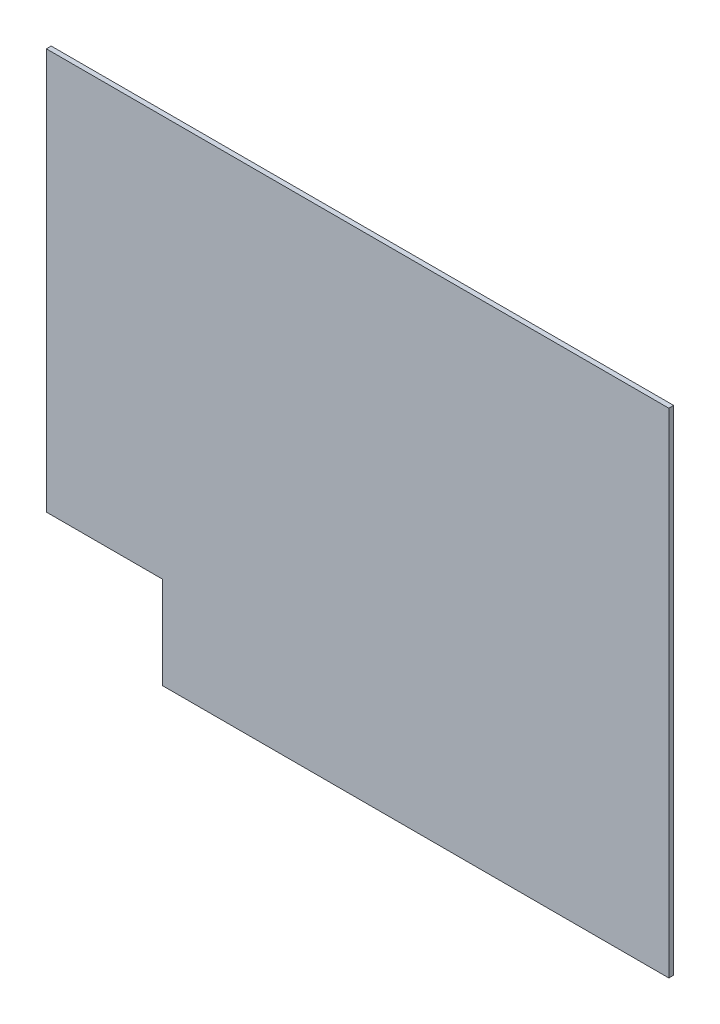
ISO-10303-21;
HEADER;
FILE_DESCRIPTION(('STEP AP214'),'2;1');
FILE_NAME('part.step','',(''),(''),'','','');
FILE_SCHEMA(('AUTOMOTIVE_DESIGN { 1 0 10303 214 1 1 1 1 }'));
ENDSEC;
DATA;
#1=APPLICATION_CONTEXT('core data for automotive mechanical design processes');
#2=APPLICATION_PROTOCOL_DEFINITION('international standard','automotive_design',2000,#1);
#3=PRODUCT_CONTEXT('',#1,'mechanical');
#4=PRODUCT('Part','Part','',(#3));
#5=PRODUCT_RELATED_PRODUCT_CATEGORY('part','',(#4));
#6=PRODUCT_DEFINITION_FORMATION('','',#4);
#7=PRODUCT_DEFINITION_CONTEXT('part definition',#1,'design');
#8=PRODUCT_DEFINITION('design','',#6,#7);
#9=PRODUCT_DEFINITION_SHAPE('','',#8);
#10=(LENGTH_UNIT() NAMED_UNIT(*) SI_UNIT(.MILLI.,.METRE.));
#11=(NAMED_UNIT(*) PLANE_ANGLE_UNIT() SI_UNIT($,.RADIAN.));
#12=(NAMED_UNIT(*) SI_UNIT($,.STERADIAN.) SOLID_ANGLE_UNIT());
#13=UNCERTAINTY_MEASURE_WITH_UNIT(LENGTH_MEASURE(1.E-05),#10,'distance_accuracy_value','');
#14=(GEOMETRIC_REPRESENTATION_CONTEXT(3) GLOBAL_UNCERTAINTY_ASSIGNED_CONTEXT((#13)) GLOBAL_UNIT_ASSIGNED_CONTEXT((#10,
#11,#12)) REPRESENTATION_CONTEXT('',''));
#15=CARTESIAN_POINT('',(0.,0.,0.));
#16=DIRECTION('',(0.,0.,1.));
#17=DIRECTION('',(1.,0.,0.));
#18=AXIS2_PLACEMENT_3D('',#15,#16,#17);
#19=CARTESIAN_POINT('',(289.5,-229.5,2.2479));
#20=DIRECTION('',(-1.,0.,0.));
#21=DIRECTION('',(0.,0.,1.));
#22=AXIS2_PLACEMENT_3D('',#19,#20,#21);
#23=PLANE('',#22);
#24=DIRECTION('',(0.,1.,0.));
#25=VECTOR('',#24,1.);
#26=CARTESIAN_POINT('',(289.5,-229.5,-2.2479));
#27=LINE('',#26,#25);
#28=CARTESIAN_POINT('',(289.5,-229.5,-2.2479));
#29=VERTEX_POINT('',#28);
#30=CARTESIAN_POINT('',(289.5,229.5,-2.2479));
#31=VERTEX_POINT('',#30);
#32=EDGE_CURVE('E108',#29,#31,#27,.T.);
#33=ORIENTED_EDGE('',*,*,#32,.T.);
#34=DIRECTION('',(0.,0.,-1.));
#35=VECTOR('',#34,1.);
#36=CARTESIAN_POINT('',(289.5,229.5,2.2479));
#37=LINE('',#36,#35);
#38=CARTESIAN_POINT('',(289.5,229.5,2.2479));
#39=VERTEX_POINT('',#38);
#40=EDGE_CURVE('E11',#39,#31,#37,.T.);
#41=ORIENTED_EDGE('',*,*,#40,.F.);
#42=DIRECTION('',(0.,1.,0.));
#43=VECTOR('',#42,1.);
#44=CARTESIAN_POINT('',(289.5,-229.5,2.2479));
#45=LINE('',#44,#43);
#46=CARTESIAN_POINT('',(289.5,-229.5,2.2479));
#47=VERTEX_POINT('',#46);
#48=EDGE_CURVE('E109',#47,#39,#45,.T.);
#49=ORIENTED_EDGE('',*,*,#48,.F.);
#50=DIRECTION('',(0.,0.,-1.));
#51=VECTOR('',#50,1.);
#52=CARTESIAN_POINT('',(289.5,-229.5,2.2479));
#53=LINE('',#52,#51);
#54=EDGE_CURVE('E118',#47,#29,#53,.T.);
#55=ORIENTED_EDGE('',*,*,#54,.T.);
#56=EDGE_LOOP('',(#33,#41,#49,#55));
#57=FACE_BOUND('',#56,.T.);
#58=ADVANCED_FACE('F33',(#57),#23,.F.);
#59=CARTESIAN_POINT('',(-289.5,229.5,2.2479));
#60=DIRECTION('',(0.,-1.,0.));
#61=DIRECTION('',(0.,0.,-1.));
#62=AXIS2_PLACEMENT_3D('',#59,#60,#61);
#63=PLANE('',#62);
#64=DIRECTION('',(-1.,0.,0.));
#65=VECTOR('',#64,1.);
#66=CARTESIAN_POINT('',(-289.5,229.5,-2.2479));
#67=LINE('',#66,#65);
#68=CARTESIAN_POINT('',(-289.5,229.5,-2.2479));
#69=VERTEX_POINT('',#68);
#70=EDGE_CURVE('E114',#31,#69,#67,.T.);
#71=ORIENTED_EDGE('',*,*,#70,.T.);
#72=DIRECTION('',(0.,0.,-1.));
#73=VECTOR('',#72,1.);
#74=CARTESIAN_POINT('',(-289.5,229.5,2.2479));
#75=LINE('',#74,#73);
#76=CARTESIAN_POINT('',(-289.5,229.5,2.2479));
#77=VERTEX_POINT('',#76);
#78=EDGE_CURVE('E40',#77,#69,#75,.T.);
#79=ORIENTED_EDGE('',*,*,#78,.F.);
#80=DIRECTION('',(-1.,0.,0.));
#81=VECTOR('',#80,1.);
#82=CARTESIAN_POINT('',(-289.5,229.5,2.2479));
#83=LINE('',#82,#81);
#84=EDGE_CURVE('E79',#39,#77,#83,.T.);
#85=ORIENTED_EDGE('',*,*,#84,.F.);
#86=ORIENTED_EDGE('',*,*,#40,.T.);
#87=EDGE_LOOP('',(#71,#79,#85,#86));
#88=FACE_BOUND('',#87,.T.);
#89=ADVANCED_FACE('F136',(#88),#63,.F.);
#90=CARTESIAN_POINT('',(-289.5,-229.5,2.2479));
#91=DIRECTION('',(1.,0.,0.));
#92=DIRECTION('',(0.,0.,-1.));
#93=AXIS2_PLACEMENT_3D('',#90,#91,#92);
#94=PLANE('',#93);
#95=DIRECTION('',(0.,-1.,0.));
#96=VECTOR('',#95,1.);
#97=CARTESIAN_POINT('',(-289.5,-229.5,-2.2479));
#98=LINE('',#97,#96);
#99=CARTESIAN_POINT('',(-289.5,-143.7,-2.2479));
#100=VERTEX_POINT('',#99);
#101=EDGE_CURVE('E110',#69,#100,#98,.T.);
#102=ORIENTED_EDGE('',*,*,#101,.T.);
#103=DIRECTION('',(0.,0.,-1.));
#104=VECTOR('',#103,1.);
#105=CARTESIAN_POINT('',(-289.5,-143.7,140.377196313273));
#106=LINE('',#105,#104);
#107=CARTESIAN_POINT('',(-289.5,-143.7,2.2479));
#108=VERTEX_POINT('',#107);
#109=EDGE_CURVE('E47',#108,#100,#106,.T.);
#110=ORIENTED_EDGE('',*,*,#109,.F.);
#111=DIRECTION('',(0.,-1.,0.));
#112=VECTOR('',#111,1.);
#113=CARTESIAN_POINT('',(-289.5,-229.5,2.2479));
#114=LINE('',#113,#112);
#115=EDGE_CURVE('E125',#77,#108,#114,.T.);
#116=ORIENTED_EDGE('',*,*,#115,.F.);
#117=ORIENTED_EDGE('',*,*,#78,.T.);
#118=EDGE_LOOP('',(#102,#110,#116,#117));
#119=FACE_BOUND('',#118,.T.);
#120=ADVANCED_FACE('F123',(#119),#94,.F.);
#121=CARTESIAN_POINT('',(-289.5,-229.5,2.2479));
#122=DIRECTION('',(0.,1.,0.));
#123=DIRECTION('',(0.,0.,1.));
#124=AXIS2_PLACEMENT_3D('',#121,#122,#123);
#125=PLANE('',#124);
#126=DIRECTION('',(1.,0.,0.));
#127=VECTOR('',#126,1.);
#128=CARTESIAN_POINT('',(-289.5,-229.5,2.2479));
#129=LINE('',#128,#127);
#130=CARTESIAN_POINT('',(-181.250000000001,-229.5,2.2479));
#131=VERTEX_POINT('',#130);
#132=EDGE_CURVE('E56',#131,#47,#129,.T.);
#133=ORIENTED_EDGE('',*,*,#132,.F.);
#134=DIRECTION('',(0.,0.,-1.));
#135=VECTOR('',#134,1.);
#136=CARTESIAN_POINT('',(-181.250000000001,-229.5,140.377196313273));
#137=LINE('',#136,#135);
#138=CARTESIAN_POINT('',(-181.250000000001,-229.5,-2.2479));
#139=VERTEX_POINT('',#138);
#140=EDGE_CURVE('E97',#131,#139,#137,.T.);
#141=ORIENTED_EDGE('',*,*,#140,.T.);
#142=DIRECTION('',(1.,0.,0.));
#143=VECTOR('',#142,1.);
#144=CARTESIAN_POINT('',(-289.5,-229.5,-2.2479));
#145=LINE('',#144,#143);
#146=EDGE_CURVE('E74',#139,#29,#145,.T.);
#147=ORIENTED_EDGE('',*,*,#146,.T.);
#148=ORIENTED_EDGE('',*,*,#54,.F.);
#149=EDGE_LOOP('',(#133,#141,#147,#148));
#150=FACE_BOUND('',#149,.T.);
#151=ADVANCED_FACE('F103',(#150),#125,.F.);
#152=CARTESIAN_POINT('',(0.,0.,2.2479));
#153=DIRECTION('',(0.,0.,-1.));
#154=DIRECTION('',(-1.,0.,0.));
#155=AXIS2_PLACEMENT_3D('',#152,#153,#154);
#156=PLANE('',#155);
#157=DIRECTION('',(-1.,0.,0.));
#158=VECTOR('',#157,1.);
#159=CARTESIAN_POINT('',(-289.5,-143.7,2.2479));
#160=LINE('',#159,#158);
#161=CARTESIAN_POINT('',(-181.250000000001,-143.7,2.2479));
#162=VERTEX_POINT('',#161);
#163=EDGE_CURVE('E130',#162,#108,#160,.T.);
#164=ORIENTED_EDGE('',*,*,#163,.F.);
#165=DIRECTION('',(0.,1.,0.));
#166=VECTOR('',#165,1.);
#167=CARTESIAN_POINT('',(-181.250000000001,-229.5,2.2479));
#168=LINE('',#167,#166);
#169=EDGE_CURVE('E135',#131,#162,#168,.T.);
#170=ORIENTED_EDGE('',*,*,#169,.F.);
#171=ORIENTED_EDGE('',*,*,#132,.T.);
#172=ORIENTED_EDGE('',*,*,#48,.T.);
#173=ORIENTED_EDGE('',*,*,#84,.T.);
#174=ORIENTED_EDGE('',*,*,#115,.T.);
#175=EDGE_LOOP('',(#164,#170,#171,#172,#173,#174));
#176=FACE_BOUND('',#175,.T.);
#177=ADVANCED_FACE('F141',(#176),#156,.F.);
#178=CARTESIAN_POINT('',(0.,0.,-2.2479));
#179=DIRECTION('',(0.,0.,-1.));
#180=DIRECTION('',(-1.,0.,0.));
#181=AXIS2_PLACEMENT_3D('',#178,#179,#180);
#182=PLANE('',#181);
#183=DIRECTION('',(0.,-1.,0.));
#184=VECTOR('',#183,1.);
#185=CARTESIAN_POINT('',(-181.250000000001,-229.5,-2.2479));
#186=LINE('',#185,#184);
#187=CARTESIAN_POINT('',(-181.250000000001,-143.7,-2.2479));
#188=VERTEX_POINT('',#187);
#189=EDGE_CURVE('E95',#188,#139,#186,.T.);
#190=ORIENTED_EDGE('',*,*,#189,.F.);
#191=DIRECTION('',(1.,0.,0.));
#192=VECTOR('',#191,1.);
#193=CARTESIAN_POINT('',(-289.5,-143.7,-2.2479));
#194=LINE('',#193,#192);
#195=EDGE_CURVE('E101',#100,#188,#194,.T.);
#196=ORIENTED_EDGE('',*,*,#195,.F.);
#197=ORIENTED_EDGE('',*,*,#101,.F.);
#198=ORIENTED_EDGE('',*,*,#70,.F.);
#199=ORIENTED_EDGE('',*,*,#32,.F.);
#200=ORIENTED_EDGE('',*,*,#146,.F.);
#201=EDGE_LOOP('',(#190,#196,#197,#198,#199,#200));
#202=FACE_BOUND('',#201,.T.);
#203=ADVANCED_FACE('F106',(#202),#182,.T.);
#204=CARTESIAN_POINT('',(-181.250000000001,-229.5,140.377196313273));
#205=DIRECTION('',(1.,0.,0.));
#206=DIRECTION('',(0.,0.,-1.));
#207=AXIS2_PLACEMENT_3D('',#204,#205,#206);
#208=PLANE('',#207);
#209=ORIENTED_EDGE('',*,*,#169,.T.);
#210=DIRECTION('',(0.,0.,-1.));
#211=VECTOR('',#210,1.);
#212=CARTESIAN_POINT('',(-181.250000000001,-143.7,140.377196313273));
#213=LINE('',#212,#211);
#214=EDGE_CURVE('E99',#162,#188,#213,.T.);
#215=ORIENTED_EDGE('',*,*,#214,.T.);
#216=ORIENTED_EDGE('',*,*,#189,.T.);
#217=ORIENTED_EDGE('',*,*,#140,.F.);
#218=EDGE_LOOP('',(#209,#215,#216,#217));
#219=FACE_BOUND('',#218,.T.);
#220=ADVANCED_FACE('F96',(#219),#208,.F.);
#221=CARTESIAN_POINT('',(-289.5,-143.7,140.377196313273));
#222=DIRECTION('',(0.,1.,0.));
#223=DIRECTION('',(-1.,0.,0.));
#224=AXIS2_PLACEMENT_3D('',#221,#222,#223);
#225=PLANE('',#224);
#226=ORIENTED_EDGE('',*,*,#163,.T.);
#227=ORIENTED_EDGE('',*,*,#109,.T.);
#228=ORIENTED_EDGE('',*,*,#195,.T.);
#229=ORIENTED_EDGE('',*,*,#214,.F.);
#230=EDGE_LOOP('',(#226,#227,#228,#229));
#231=FACE_BOUND('',#230,.T.);
#232=ADVANCED_FACE('F143',(#231),#225,.F.);
#233=CLOSED_SHELL('',(#58,#89,#120,#151,#177,#203,#220,#232));
#234=MANIFOLD_SOLID_BREP('B2',#233);
#235=ADVANCED_BREP_SHAPE_REPRESENTATION('',(#18,#234),#14);
#236=SHAPE_DEFINITION_REPRESENTATION(#9,#235);
ENDSEC;
END-ISO-10303-21;
